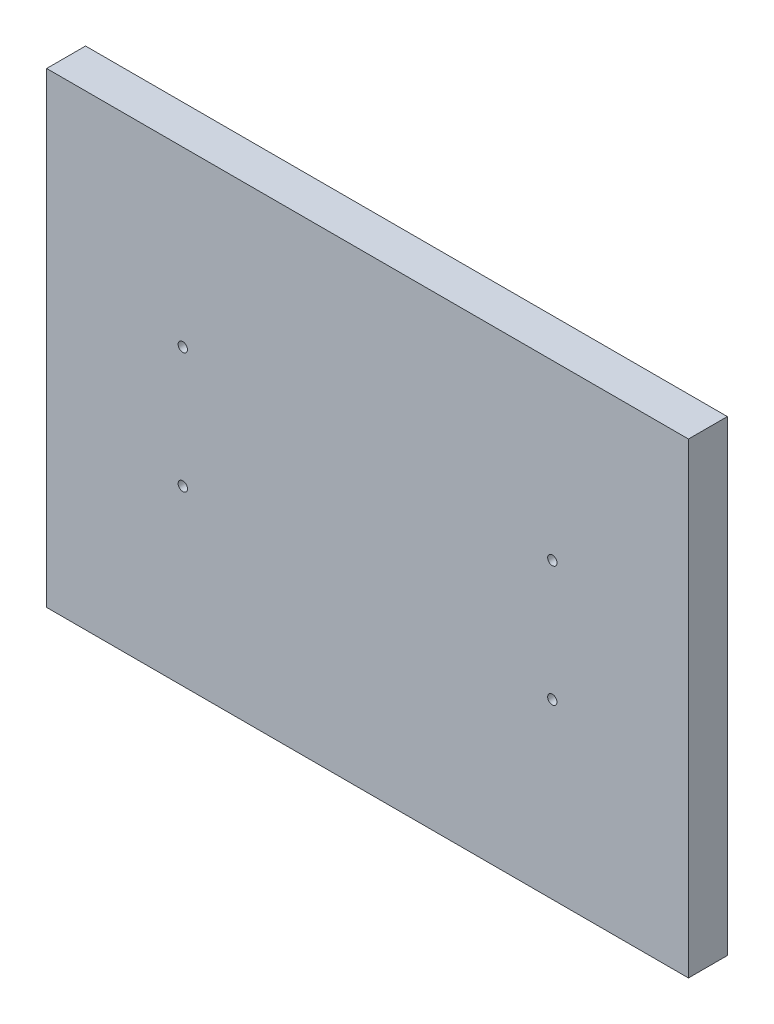
ISO-10303-21;
HEADER;
FILE_DESCRIPTION(('STEP AP214'),'2;1');
FILE_NAME('part.step','',(''),(''),'','','');
FILE_SCHEMA(('AUTOMOTIVE_DESIGN { 1 0 10303 214 1 1 1 1 }'));
ENDSEC;
DATA;
#1=APPLICATION_CONTEXT('core data for automotive mechanical design processes');
#2=APPLICATION_PROTOCOL_DEFINITION('international standard','automotive_design',2000,#1);
#3=PRODUCT_CONTEXT('',#1,'mechanical');
#4=PRODUCT('Part','Part','',(#3));
#5=PRODUCT_RELATED_PRODUCT_CATEGORY('part','',(#4));
#6=PRODUCT_DEFINITION_FORMATION('','',#4);
#7=PRODUCT_DEFINITION_CONTEXT('part definition',#1,'design');
#8=PRODUCT_DEFINITION('design','',#6,#7);
#9=PRODUCT_DEFINITION_SHAPE('','',#8);
#10=(LENGTH_UNIT() NAMED_UNIT(*) SI_UNIT(.MILLI.,.METRE.));
#11=(NAMED_UNIT(*) PLANE_ANGLE_UNIT() SI_UNIT($,.RADIAN.));
#12=(NAMED_UNIT(*) SI_UNIT($,.STERADIAN.) SOLID_ANGLE_UNIT());
#13=UNCERTAINTY_MEASURE_WITH_UNIT(LENGTH_MEASURE(1.E-05),#10,'distance_accuracy_value','');
#14=(GEOMETRIC_REPRESENTATION_CONTEXT(3) GLOBAL_UNCERTAINTY_ASSIGNED_CONTEXT((#13)) GLOBAL_UNIT_ASSIGNED_CONTEXT((#10,
#11,#12)) REPRESENTATION_CONTEXT('',''));
#15=CARTESIAN_POINT('',(0.,0.,0.));
#16=DIRECTION('',(0.,0.,1.));
#17=DIRECTION('',(1.,0.,0.));
#18=AXIS2_PLACEMENT_3D('',#15,#16,#17);
#19=CARTESIAN_POINT('',(0.,0.,10.));
#20=DIRECTION('',(0.,0.,1.));
#21=DIRECTION('',(1.,0.,0.));
#22=AXIS2_PLACEMENT_3D('',#19,#20,#21);
#23=PLANE('',#22);
#24=CARTESIAN_POINT('',(47.5,-15.5,10.));
#25=DIRECTION('',(0.,0.,1.));
#26=DIRECTION('',(1.,0.,0.));
#27=AXIS2_PLACEMENT_3D('',#24,#25,#26);
#28=CIRCLE('',#27,1.2);
#29=CARTESIAN_POINT('',(48.7,-15.5,10.));
#30=VERTEX_POINT('',#29);
#31=EDGE_CURVE('E121',#30,#30,#28,.T.);
#32=ORIENTED_EDGE('',*,*,#31,.F.);
#33=EDGE_LOOP('',(#32));
#34=FACE_BOUND('',#33,.T.);
#35=CARTESIAN_POINT('',(-47.5,15.5,10.));
#36=DIRECTION('',(0.,0.,1.));
#37=DIRECTION('',(1.,0.,0.));
#38=AXIS2_PLACEMENT_3D('',#35,#36,#37);
#39=CIRCLE('',#38,1.2);
#40=CARTESIAN_POINT('',(-46.3,15.5,10.));
#41=VERTEX_POINT('',#40);
#42=EDGE_CURVE('E100',#41,#41,#39,.T.);
#43=ORIENTED_EDGE('',*,*,#42,.F.);
#44=EDGE_LOOP('',(#43));
#45=FACE_BOUND('',#44,.T.);
#46=DIRECTION('',(0.,1.,0.));
#47=VECTOR('',#46,1.);
#48=CARTESIAN_POINT('',(82.5,60.,10.));
#49=LINE('',#48,#47);
#50=CARTESIAN_POINT('',(82.5000000000001,-60.,10.));
#51=VERTEX_POINT('',#50);
#52=CARTESIAN_POINT('',(82.5,60.,10.));
#53=VERTEX_POINT('',#52);
#54=EDGE_CURVE('E85',#51,#53,#49,.T.);
#55=ORIENTED_EDGE('',*,*,#54,.T.);
#56=DIRECTION('',(-1.,0.,0.));
#57=VECTOR('',#56,1.);
#58=CARTESIAN_POINT('',(-82.5,60.,10.));
#59=LINE('',#58,#57);
#60=CARTESIAN_POINT('',(-82.5,60.,10.));
#61=VERTEX_POINT('',#60);
#62=EDGE_CURVE('E80',#53,#61,#59,.T.);
#63=ORIENTED_EDGE('',*,*,#62,.T.);
#64=DIRECTION('',(0.,-1.,0.));
#65=VECTOR('',#64,1.);
#66=CARTESIAN_POINT('',(-82.5,60.,10.));
#67=LINE('',#66,#65);
#68=CARTESIAN_POINT('',(-82.5,-60.,10.));
#69=VERTEX_POINT('',#68);
#70=EDGE_CURVE('E83',#61,#69,#67,.T.);
#71=ORIENTED_EDGE('',*,*,#70,.T.);
#72=DIRECTION('',(1.,0.,0.));
#73=VECTOR('',#72,1.);
#74=CARTESIAN_POINT('',(-82.5,-60.,10.));
#75=LINE('',#74,#73);
#76=EDGE_CURVE('E50',#69,#51,#75,.T.);
#77=ORIENTED_EDGE('',*,*,#76,.T.);
#78=EDGE_LOOP('',(#55,#63,#71,#77));
#79=FACE_BOUND('',#78,.T.);
#80=CARTESIAN_POINT('',(-47.5,-15.5,10.));
#81=DIRECTION('',(0.,0.,1.));
#82=DIRECTION('',(1.,0.,0.));
#83=AXIS2_PLACEMENT_3D('',#80,#81,#82);
#84=CIRCLE('',#83,1.2);
#85=CARTESIAN_POINT('',(-46.3,-15.5,10.));
#86=VERTEX_POINT('',#85);
#87=EDGE_CURVE('E115',#86,#86,#84,.T.);
#88=ORIENTED_EDGE('',*,*,#87,.F.);
#89=EDGE_LOOP('',(#88));
#90=FACE_BOUND('',#89,.T.);
#91=CARTESIAN_POINT('',(47.5,15.5,10.));
#92=DIRECTION('',(0.,0.,1.));
#93=DIRECTION('',(1.,0.,0.));
#94=AXIS2_PLACEMENT_3D('',#91,#92,#93);
#95=CIRCLE('',#94,1.2);
#96=CARTESIAN_POINT('',(48.7,15.5,10.));
#97=VERTEX_POINT('',#96);
#98=EDGE_CURVE('E127',#97,#97,#95,.T.);
#99=ORIENTED_EDGE('',*,*,#98,.F.);
#100=EDGE_LOOP('',(#99));
#101=FACE_BOUND('',#100,.T.);
#102=ADVANCED_FACE('F33',(#34,#45,#79,#90,#101),#23,.T.);
#103=CARTESIAN_POINT('',(0.,0.,0.));
#104=DIRECTION('',(0.,0.,1.));
#105=DIRECTION('',(1.,0.,0.));
#106=AXIS2_PLACEMENT_3D('',#103,#104,#105);
#107=PLANE('',#106);
#108=CARTESIAN_POINT('',(47.5,-15.5,0.));
#109=DIRECTION('',(0.,0.,1.));
#110=DIRECTION('',(1.,0.,0.));
#111=AXIS2_PLACEMENT_3D('',#108,#109,#110);
#112=CIRCLE('',#111,1.2);
#113=CARTESIAN_POINT('',(48.7,-15.5,0.));
#114=VERTEX_POINT('',#113);
#115=EDGE_CURVE('E124',#114,#114,#112,.T.);
#116=ORIENTED_EDGE('',*,*,#115,.T.);
#117=EDGE_LOOP('',(#116));
#118=FACE_BOUND('',#117,.T.);
#119=CARTESIAN_POINT('',(-47.5,15.5,0.));
#120=DIRECTION('',(0.,0.,1.));
#121=DIRECTION('',(1.,0.,0.));
#122=AXIS2_PLACEMENT_3D('',#119,#120,#121);
#123=CIRCLE('',#122,1.2);
#124=CARTESIAN_POINT('',(-46.3,15.5,0.));
#125=VERTEX_POINT('',#124);
#126=EDGE_CURVE('E112',#125,#125,#123,.T.);
#127=ORIENTED_EDGE('',*,*,#126,.T.);
#128=EDGE_LOOP('',(#127));
#129=FACE_BOUND('',#128,.T.);
#130=DIRECTION('',(0.,1.,0.));
#131=VECTOR('',#130,1.);
#132=CARTESIAN_POINT('',(82.5,60.,0.));
#133=LINE('',#132,#131);
#134=CARTESIAN_POINT('',(82.5000000000001,-60.,0.));
#135=VERTEX_POINT('',#134);
#136=CARTESIAN_POINT('',(82.5,60.,0.));
#137=VERTEX_POINT('',#136);
#138=EDGE_CURVE('E97',#135,#137,#133,.T.);
#139=ORIENTED_EDGE('',*,*,#138,.F.);
#140=DIRECTION('',(1.,0.,0.));
#141=VECTOR('',#140,1.);
#142=CARTESIAN_POINT('',(-82.5,-60.,0.));
#143=LINE('',#142,#141);
#144=CARTESIAN_POINT('',(-82.5,-60.,0.));
#145=VERTEX_POINT('',#144);
#146=EDGE_CURVE('E73',#145,#135,#143,.T.);
#147=ORIENTED_EDGE('',*,*,#146,.F.);
#148=DIRECTION('',(0.,-1.,0.));
#149=VECTOR('',#148,1.);
#150=CARTESIAN_POINT('',(-82.5,60.,0.));
#151=LINE('',#150,#149);
#152=CARTESIAN_POINT('',(-82.5,60.,0.));
#153=VERTEX_POINT('',#152);
#154=EDGE_CURVE('E67',#153,#145,#151,.T.);
#155=ORIENTED_EDGE('',*,*,#154,.F.);
#156=DIRECTION('',(-1.,0.,0.));
#157=VECTOR('',#156,1.);
#158=CARTESIAN_POINT('',(-82.5,60.,0.));
#159=LINE('',#158,#157);
#160=EDGE_CURVE('E89',#137,#153,#159,.T.);
#161=ORIENTED_EDGE('',*,*,#160,.F.);
#162=EDGE_LOOP('',(#139,#147,#155,#161));
#163=FACE_BOUND('',#162,.T.);
#164=CARTESIAN_POINT('',(-47.5,-15.5,0.));
#165=DIRECTION('',(0.,0.,1.));
#166=DIRECTION('',(1.,0.,0.));
#167=AXIS2_PLACEMENT_3D('',#164,#165,#166);
#168=CIRCLE('',#167,1.2);
#169=CARTESIAN_POINT('',(-46.3,-15.5,0.));
#170=VERTEX_POINT('',#169);
#171=EDGE_CURVE('E118',#170,#170,#168,.T.);
#172=ORIENTED_EDGE('',*,*,#171,.T.);
#173=EDGE_LOOP('',(#172));
#174=FACE_BOUND('',#173,.T.);
#175=CARTESIAN_POINT('',(47.5,15.5,0.));
#176=DIRECTION('',(0.,0.,1.));
#177=DIRECTION('',(1.,0.,0.));
#178=AXIS2_PLACEMENT_3D('',#175,#176,#177);
#179=CIRCLE('',#178,1.2);
#180=CARTESIAN_POINT('',(48.7,15.5,0.));
#181=VERTEX_POINT('',#180);
#182=EDGE_CURVE('E130',#181,#181,#179,.T.);
#183=ORIENTED_EDGE('',*,*,#182,.T.);
#184=EDGE_LOOP('',(#183));
#185=FACE_BOUND('',#184,.T.);
#186=ADVANCED_FACE('F108',(#118,#129,#163,#174,#185),#107,.F.);
#187=CARTESIAN_POINT('',(82.5,60.,10.));
#188=DIRECTION('',(-1.,0.,0.));
#189=DIRECTION('',(0.,-1.,0.));
#190=AXIS2_PLACEMENT_3D('',#187,#188,#189);
#191=PLANE('',#190);
#192=ORIENTED_EDGE('',*,*,#138,.T.);
#193=DIRECTION('',(0.,0.,-1.));
#194=VECTOR('',#193,1.);
#195=CARTESIAN_POINT('',(82.5,60.,10.));
#196=LINE('',#195,#194);
#197=EDGE_CURVE('E11',#53,#137,#196,.T.);
#198=ORIENTED_EDGE('',*,*,#197,.F.);
#199=ORIENTED_EDGE('',*,*,#54,.F.);
#200=DIRECTION('',(0.,0.,-1.));
#201=VECTOR('',#200,1.);
#202=CARTESIAN_POINT('',(82.5000000000001,-60.,10.));
#203=LINE('',#202,#201);
#204=EDGE_CURVE('E93',#51,#135,#203,.T.);
#205=ORIENTED_EDGE('',*,*,#204,.T.);
#206=EDGE_LOOP('',(#192,#198,#199,#205));
#207=FACE_BOUND('',#206,.T.);
#208=ADVANCED_FACE('F35',(#207),#191,.F.);
#209=CARTESIAN_POINT('',(-82.5,60.,10.));
#210=DIRECTION('',(0.,-1.,0.));
#211=DIRECTION('',(0.,0.,-1.));
#212=AXIS2_PLACEMENT_3D('',#209,#210,#211);
#213=PLANE('',#212);
#214=ORIENTED_EDGE('',*,*,#160,.T.);
#215=DIRECTION('',(0.,0.,-1.));
#216=VECTOR('',#215,1.);
#217=CARTESIAN_POINT('',(-82.5,60.,10.));
#218=LINE('',#217,#216);
#219=EDGE_CURVE('E42',#61,#153,#218,.T.);
#220=ORIENTED_EDGE('',*,*,#219,.F.);
#221=ORIENTED_EDGE('',*,*,#62,.F.);
#222=ORIENTED_EDGE('',*,*,#197,.T.);
#223=EDGE_LOOP('',(#214,#220,#221,#222));
#224=FACE_BOUND('',#223,.T.);
#225=ADVANCED_FACE('F88',(#224),#213,.F.);
#226=CARTESIAN_POINT('',(-82.5,60.,10.));
#227=DIRECTION('',(1.,0.,0.));
#228=DIRECTION('',(0.,0.,-1.));
#229=AXIS2_PLACEMENT_3D('',#226,#227,#228);
#230=PLANE('',#229);
#231=ORIENTED_EDGE('',*,*,#154,.T.);
#232=DIRECTION('',(0.,0.,-1.));
#233=VECTOR('',#232,1.);
#234=CARTESIAN_POINT('',(-82.5,-60.,10.));
#235=LINE('',#234,#233);
#236=EDGE_CURVE('E90',#69,#145,#235,.T.);
#237=ORIENTED_EDGE('',*,*,#236,.F.);
#238=ORIENTED_EDGE('',*,*,#70,.F.);
#239=ORIENTED_EDGE('',*,*,#219,.T.);
#240=EDGE_LOOP('',(#231,#237,#238,#239));
#241=FACE_BOUND('',#240,.T.);
#242=ADVANCED_FACE('F91',(#241),#230,.F.);
#243=CARTESIAN_POINT('',(-82.5,-60.,10.));
#244=DIRECTION('',(0.,1.,0.));
#245=DIRECTION('',(0.,0.,1.));
#246=AXIS2_PLACEMENT_3D('',#243,#244,#245);
#247=PLANE('',#246);
#248=ORIENTED_EDGE('',*,*,#146,.T.);
#249=ORIENTED_EDGE('',*,*,#204,.F.);
#250=ORIENTED_EDGE('',*,*,#76,.F.);
#251=ORIENTED_EDGE('',*,*,#236,.T.);
#252=EDGE_LOOP('',(#248,#249,#250,#251));
#253=FACE_BOUND('',#252,.T.);
#254=ADVANCED_FACE('F105',(#253),#247,.F.);
#255=CARTESIAN_POINT('',(-47.5,15.5,10.));
#256=DIRECTION('',(0.,0.,-1.));
#257=DIRECTION('',(-1.,0.,0.));
#258=AXIS2_PLACEMENT_3D('',#255,#256,#257);
#259=CYLINDRICAL_SURFACE('',#258,1.2);
#260=ORIENTED_EDGE('',*,*,#42,.T.);
#261=EDGE_LOOP('',(#260));
#262=FACE_BOUND('',#261,.T.);
#263=ORIENTED_EDGE('',*,*,#126,.F.);
#264=EDGE_LOOP('',(#263));
#265=FACE_BOUND('',#264,.T.);
#266=ADVANCED_FACE('F150',(#262,#265),#259,.F.);
#267=CARTESIAN_POINT('',(-47.5,-15.5,10.));
#268=DIRECTION('',(0.,0.,-1.));
#269=DIRECTION('',(-1.,0.,0.));
#270=AXIS2_PLACEMENT_3D('',#267,#268,#269);
#271=CYLINDRICAL_SURFACE('',#270,1.2);
#272=ORIENTED_EDGE('',*,*,#87,.T.);
#273=EDGE_LOOP('',(#272));
#274=FACE_BOUND('',#273,.T.);
#275=ORIENTED_EDGE('',*,*,#171,.F.);
#276=EDGE_LOOP('',(#275));
#277=FACE_BOUND('',#276,.T.);
#278=ADVANCED_FACE('F196',(#274,#277),#271,.F.);
#279=CARTESIAN_POINT('',(47.5,-15.5,10.));
#280=DIRECTION('',(0.,0.,-1.));
#281=DIRECTION('',(-1.,0.,0.));
#282=AXIS2_PLACEMENT_3D('',#279,#280,#281);
#283=CYLINDRICAL_SURFACE('',#282,1.2);
#284=ORIENTED_EDGE('',*,*,#31,.T.);
#285=EDGE_LOOP('',(#284));
#286=FACE_BOUND('',#285,.T.);
#287=ORIENTED_EDGE('',*,*,#115,.F.);
#288=EDGE_LOOP('',(#287));
#289=FACE_BOUND('',#288,.T.);
#290=ADVANCED_FACE('F204',(#286,#289),#283,.F.);
#291=CARTESIAN_POINT('',(47.5,15.5,10.));
#292=DIRECTION('',(0.,0.,-1.));
#293=DIRECTION('',(-1.,0.,0.));
#294=AXIS2_PLACEMENT_3D('',#291,#292,#293);
#295=CYLINDRICAL_SURFACE('',#294,1.2);
#296=ORIENTED_EDGE('',*,*,#98,.T.);
#297=EDGE_LOOP('',(#296));
#298=FACE_BOUND('',#297,.T.);
#299=ORIENTED_EDGE('',*,*,#182,.F.);
#300=EDGE_LOOP('',(#299));
#301=FACE_BOUND('',#300,.T.);
#302=ADVANCED_FACE('F136',(#298,#301),#295,.F.);
#303=CLOSED_SHELL('',(#102,#186,#208,#225,#242,#254,#266,#278,#290,#302));
#304=MANIFOLD_SOLID_BREP('B2',#303);
#305=ADVANCED_BREP_SHAPE_REPRESENTATION('',(#18,#304),#14);
#306=SHAPE_DEFINITION_REPRESENTATION(#9,#305);
ENDSEC;
END-ISO-10303-21;
